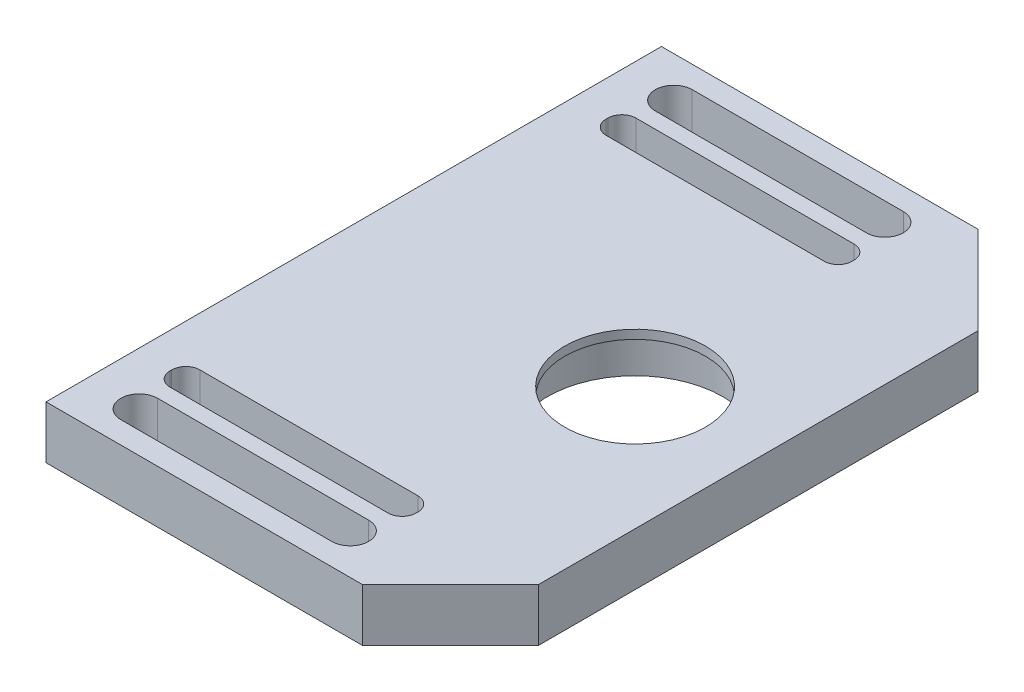
ISO-10303-21;
HEADER;
FILE_DESCRIPTION(('STEP AP214'),'2;1');
FILE_NAME('part.step','',(''),(''),'','','');
FILE_SCHEMA(('AUTOMOTIVE_DESIGN { 1 0 10303 214 1 1 1 1 }'));
ENDSEC;
DATA;
#1=APPLICATION_CONTEXT('core data for automotive mechanical design processes');
#2=APPLICATION_PROTOCOL_DEFINITION('international standard','automotive_design',2000,#1);
#3=PRODUCT_CONTEXT('',#1,'mechanical');
#4=PRODUCT('Part','Part','',(#3));
#5=PRODUCT_RELATED_PRODUCT_CATEGORY('part','',(#4));
#6=PRODUCT_DEFINITION_FORMATION('','',#4);
#7=PRODUCT_DEFINITION_CONTEXT('part definition',#1,'design');
#8=PRODUCT_DEFINITION('design','',#6,#7);
#9=PRODUCT_DEFINITION_SHAPE('','',#8);
#10=(LENGTH_UNIT() NAMED_UNIT(*) SI_UNIT(.MILLI.,.METRE.));
#11=(NAMED_UNIT(*) PLANE_ANGLE_UNIT() SI_UNIT($,.RADIAN.));
#12=(NAMED_UNIT(*) SI_UNIT($,.STERADIAN.) SOLID_ANGLE_UNIT());
#13=UNCERTAINTY_MEASURE_WITH_UNIT(LENGTH_MEASURE(1.E-05),#10,'distance_accuracy_value','');
#14=(GEOMETRIC_REPRESENTATION_CONTEXT(3) GLOBAL_UNCERTAINTY_ASSIGNED_CONTEXT((#13)) GLOBAL_UNIT_ASSIGNED_CONTEXT((#10,
#11,#12)) REPRESENTATION_CONTEXT('',''));
#15=CARTESIAN_POINT('',(0.,0.,0.));
#16=DIRECTION('',(0.,0.,1.));
#17=DIRECTION('',(1.,0.,0.));
#18=AXIS2_PLACEMENT_3D('',#15,#16,#17);
#19=CARTESIAN_POINT('',(-9.,-1.5,-17.5));
#20=DIRECTION('',(-1.,0.,0.));
#21=DIRECTION('',(0.,0.,1.));
#22=AXIS2_PLACEMENT_3D('',#19,#20,#21);
#23=PLANE('',#22);
#24=DIRECTION('',(0.,0.,1.));
#25=VECTOR('',#24,1.);
#26=CARTESIAN_POINT('',(-9.,1.5,-17.5));
#27=LINE('',#26,#25);
#28=CARTESIAN_POINT('',(-9.,1.5,-17.5));
#29=VERTEX_POINT('',#28);
#30=CARTESIAN_POINT('',(-9.,1.5,17.5));
#31=VERTEX_POINT('',#30);
#32=EDGE_CURVE('E323',#29,#31,#27,.T.);
#33=ORIENTED_EDGE('',*,*,#32,.F.);
#34=DIRECTION('',(0.,1.,0.));
#35=VECTOR('',#34,1.);
#36=CARTESIAN_POINT('',(-9.,-1.5,-17.5));
#37=LINE('',#36,#35);
#38=CARTESIAN_POINT('',(-9.,-1.5,-17.5));
#39=VERTEX_POINT('',#38);
#40=EDGE_CURVE('E369',#39,#29,#37,.T.);
#41=ORIENTED_EDGE('',*,*,#40,.F.);
#42=DIRECTION('',(0.,0.,1.));
#43=VECTOR('',#42,1.);
#44=CARTESIAN_POINT('',(-9.,-1.5,-17.5));
#45=LINE('',#44,#43);
#46=CARTESIAN_POINT('',(-9.,-1.5,17.5));
#47=VERTEX_POINT('',#46);
#48=EDGE_CURVE('E333',#39,#47,#45,.T.);
#49=ORIENTED_EDGE('',*,*,#48,.T.);
#50=DIRECTION('',(0.,1.,0.));
#51=VECTOR('',#50,1.);
#52=CARTESIAN_POINT('',(-9.,-1.5,17.5));
#53=LINE('',#52,#51);
#54=EDGE_CURVE('E352',#47,#31,#53,.T.);
#55=ORIENTED_EDGE('',*,*,#54,.T.);
#56=EDGE_LOOP('',(#33,#41,#49,#55));
#57=FACE_BOUND('',#56,.T.);
#58=ADVANCED_FACE('F34',(#57),#23,.T.);
#59=CARTESIAN_POINT('',(-9.,-1.5,-17.5));
#60=DIRECTION('',(0.,0.,-1.));
#61=DIRECTION('',(-1.,0.,0.));
#62=AXIS2_PLACEMENT_3D('',#59,#60,#61);
#63=PLANE('',#62);
#64=DIRECTION('',(-1.,0.,0.));
#65=VECTOR('',#64,1.);
#66=CARTESIAN_POINT('',(-9.,1.5,-17.5));
#67=LINE('',#66,#65);
#68=CARTESIAN_POINT('',(9.,1.5,-17.5));
#69=VERTEX_POINT('',#68);
#70=EDGE_CURVE('E337',#69,#29,#67,.T.);
#71=ORIENTED_EDGE('',*,*,#70,.F.);
#72=DIRECTION('',(0.,1.,0.));
#73=VECTOR('',#72,1.);
#74=CARTESIAN_POINT('',(9.,-1.5,-17.5));
#75=LINE('',#74,#73);
#76=CARTESIAN_POINT('',(9.,-1.5,-17.5));
#77=VERTEX_POINT('',#76);
#78=EDGE_CURVE('E372',#77,#69,#75,.T.);
#79=ORIENTED_EDGE('',*,*,#78,.F.);
#80=DIRECTION('',(-1.,0.,0.));
#81=VECTOR('',#80,1.);
#82=CARTESIAN_POINT('',(-9.,-1.5,-17.5));
#83=LINE('',#82,#81);
#84=EDGE_CURVE('E349',#77,#39,#83,.T.);
#85=ORIENTED_EDGE('',*,*,#84,.T.);
#86=ORIENTED_EDGE('',*,*,#40,.T.);
#87=EDGE_LOOP('',(#71,#79,#85,#86));
#88=FACE_BOUND('',#87,.T.);
#89=ADVANCED_FACE('F494',(#88),#63,.T.);
#90=CARTESIAN_POINT('',(14.,-1.5,-12.5));
#91=DIRECTION('',(0.707106781186549,0.,-0.707106781186546));
#92=DIRECTION('',(-0.707106781186546,0.,-0.707106781186549));
#93=AXIS2_PLACEMENT_3D('',#90,#91,#92);
#94=PLANE('',#93);
#95=DIRECTION('',(-0.707106781186546,0.,-0.707106781186549));
#96=VECTOR('',#95,1.);
#97=CARTESIAN_POINT('',(14.,1.5,-12.5));
#98=LINE('',#97,#96);
#99=CARTESIAN_POINT('',(14.,1.5,-12.5));
#100=VERTEX_POINT('',#99);
#101=EDGE_CURVE('E364',#100,#69,#98,.T.);
#102=ORIENTED_EDGE('',*,*,#101,.F.);
#103=DIRECTION('',(0.,1.,0.));
#104=VECTOR('',#103,1.);
#105=CARTESIAN_POINT('',(14.,-1.5,-12.5));
#106=LINE('',#105,#104);
#107=CARTESIAN_POINT('',(14.,-1.5,-12.5));
#108=VERTEX_POINT('',#107);
#109=EDGE_CURVE('E374',#108,#100,#106,.T.);
#110=ORIENTED_EDGE('',*,*,#109,.F.);
#111=DIRECTION('',(-0.707106781186546,0.,-0.707106781186549));
#112=VECTOR('',#111,1.);
#113=CARTESIAN_POINT('',(14.,-1.5,-12.5));
#114=LINE('',#113,#112);
#115=EDGE_CURVE('E346',#108,#77,#114,.T.);
#116=ORIENTED_EDGE('',*,*,#115,.T.);
#117=ORIENTED_EDGE('',*,*,#78,.T.);
#118=EDGE_LOOP('',(#102,#110,#116,#117));
#119=FACE_BOUND('',#118,.T.);
#120=ADVANCED_FACE('F500',(#119),#94,.T.);
#121=CARTESIAN_POINT('',(14.,-1.5,12.5));
#122=DIRECTION('',(1.,0.,0.));
#123=DIRECTION('',(0.,0.,-1.));
#124=AXIS2_PLACEMENT_3D('',#121,#122,#123);
#125=PLANE('',#124);
#126=DIRECTION('',(0.,0.,-1.));
#127=VECTOR('',#126,1.);
#128=CARTESIAN_POINT('',(14.,1.5,12.5));
#129=LINE('',#128,#127);
#130=CARTESIAN_POINT('',(14.,1.5,12.5));
#131=VERTEX_POINT('',#130);
#132=EDGE_CURVE('E361',#131,#100,#129,.T.);
#133=ORIENTED_EDGE('',*,*,#132,.F.);
#134=DIRECTION('',(0.,1.,0.));
#135=VECTOR('',#134,1.);
#136=CARTESIAN_POINT('',(14.,-1.5,12.5));
#137=LINE('',#136,#135);
#138=CARTESIAN_POINT('',(14.,-1.5,12.5));
#139=VERTEX_POINT('',#138);
#140=EDGE_CURVE('E376',#139,#131,#137,.T.);
#141=ORIENTED_EDGE('',*,*,#140,.F.);
#142=DIRECTION('',(0.,0.,-1.));
#143=VECTOR('',#142,1.);
#144=CARTESIAN_POINT('',(14.,-1.5,12.5));
#145=LINE('',#144,#143);
#146=EDGE_CURVE('E343',#139,#108,#145,.T.);
#147=ORIENTED_EDGE('',*,*,#146,.T.);
#148=ORIENTED_EDGE('',*,*,#109,.T.);
#149=EDGE_LOOP('',(#133,#141,#147,#148));
#150=FACE_BOUND('',#149,.T.);
#151=ADVANCED_FACE('F628',(#150),#125,.T.);
#152=CARTESIAN_POINT('',(9.,-1.5,17.5));
#153=DIRECTION('',(0.707106781186549,0.,0.707106781186546));
#154=DIRECTION('',(0.707106781186546,0.,-0.707106781186549));
#155=AXIS2_PLACEMENT_3D('',#152,#153,#154);
#156=PLANE('',#155);
#157=DIRECTION('',(0.707106781186546,0.,-0.707106781186549));
#158=VECTOR('',#157,1.);
#159=CARTESIAN_POINT('',(9.,1.5,17.5));
#160=LINE('',#159,#158);
#161=CARTESIAN_POINT('',(9.,1.5,17.5));
#162=VERTEX_POINT('',#161);
#163=EDGE_CURVE('E358',#162,#131,#160,.T.);
#164=ORIENTED_EDGE('',*,*,#163,.F.);
#165=DIRECTION('',(0.,1.,0.));
#166=VECTOR('',#165,1.);
#167=CARTESIAN_POINT('',(9.,-1.5,17.5));
#168=LINE('',#167,#166);
#169=CARTESIAN_POINT('',(9.,-1.5,17.5));
#170=VERTEX_POINT('',#169);
#171=EDGE_CURVE('E378',#170,#162,#168,.T.);
#172=ORIENTED_EDGE('',*,*,#171,.F.);
#173=DIRECTION('',(0.707106781186546,0.,-0.707106781186549));
#174=VECTOR('',#173,1.);
#175=CARTESIAN_POINT('',(9.,-1.5,17.5));
#176=LINE('',#175,#174);
#177=EDGE_CURVE('E340',#170,#139,#176,.T.);
#178=ORIENTED_EDGE('',*,*,#177,.T.);
#179=ORIENTED_EDGE('',*,*,#140,.T.);
#180=EDGE_LOOP('',(#164,#172,#178,#179));
#181=FACE_BOUND('',#180,.T.);
#182=ADVANCED_FACE('F631',(#181),#156,.T.);
#183=CARTESIAN_POINT('',(-9.,-1.5,17.5));
#184=DIRECTION('',(0.,0.,1.));
#185=DIRECTION('',(1.,0.,0.));
#186=AXIS2_PLACEMENT_3D('',#183,#184,#185);
#187=PLANE('',#186);
#188=DIRECTION('',(1.,0.,0.));
#189=VECTOR('',#188,1.);
#190=CARTESIAN_POINT('',(-9.,1.5,17.5));
#191=LINE('',#190,#189);
#192=EDGE_CURVE('E355',#31,#162,#191,.T.);
#193=ORIENTED_EDGE('',*,*,#192,.F.);
#194=ORIENTED_EDGE('',*,*,#54,.F.);
#195=DIRECTION('',(1.,0.,0.));
#196=VECTOR('',#195,1.);
#197=CARTESIAN_POINT('',(-9.,-1.5,17.5));
#198=LINE('',#197,#196);
#199=EDGE_CURVE('E336',#47,#170,#198,.T.);
#200=ORIENTED_EDGE('',*,*,#199,.T.);
#201=ORIENTED_EDGE('',*,*,#171,.T.);
#202=EDGE_LOOP('',(#193,#194,#200,#201));
#203=FACE_BOUND('',#202,.T.);
#204=ADVANCED_FACE('F506',(#203),#187,.T.);
#205=CARTESIAN_POINT('',(0.,-1.5,0.));
#206=DIRECTION('',(0.,1.,0.));
#207=DIRECTION('',(0.,0.,1.));
#208=AXIS2_PLACEMENT_3D('',#205,#206,#207);
#209=PLANE('',#208);
#210=CARTESIAN_POINT('',(7.,-1.5,0.));
#211=DIRECTION('',(0.,-1.,0.));
#212=DIRECTION('',(0.,0.,-1.));
#213=AXIS2_PLACEMENT_3D('',#210,#211,#212);
#214=CIRCLE('',#213,5.);
#215=CARTESIAN_POINT('',(7.,-1.5,-5.));
#216=VERTEX_POINT('',#215);
#217=EDGE_CURVE('E811',#216,#216,#214,.T.);
#218=ORIENTED_EDGE('',*,*,#217,.F.);
#219=EDGE_LOOP('',(#218));
#220=FACE_BOUND('',#219,.T.);
#221=DIRECTION('',(-1.,0.,0.));
#222=VECTOR('',#221,1.);
#223=CARTESIAN_POINT('',(-7.,-1.5,11.55));
#224=LINE('',#223,#222);
#225=CARTESIAN_POINT('',(6.2,-1.5,11.55));
#226=VERTEX_POINT('',#225);
#227=CARTESIAN_POINT('',(-6.2,-1.5,11.55));
#228=VERTEX_POINT('',#227);
#229=EDGE_CURVE('E540',#226,#228,#224,.T.);
#230=ORIENTED_EDGE('',*,*,#229,.T.);
#231=CARTESIAN_POINT('',(-6.2,-1.5,12.35));
#232=DIRECTION('',(0.,1.,0.));
#233=DIRECTION('',(0.,0.,1.));
#234=AXIS2_PLACEMENT_3D('',#231,#232,#233);
#235=CIRCLE('',#234,0.8);
#236=CARTESIAN_POINT('',(-7.,-1.5,12.35));
#237=VERTEX_POINT('',#236);
#238=EDGE_CURVE('E433',#228,#237,#235,.T.);
#239=ORIENTED_EDGE('',*,*,#238,.T.);
#240=DIRECTION('',(0.,0.,1.));
#241=VECTOR('',#240,1.);
#242=CARTESIAN_POINT('',(-7.,-1.5,13.25));
#243=LINE('',#242,#241);
#244=CARTESIAN_POINT('',(-7.,-1.5,12.45));
#245=VERTEX_POINT('',#244);
#246=EDGE_CURVE('E270',#237,#245,#243,.T.);
#247=ORIENTED_EDGE('',*,*,#246,.T.);
#248=CARTESIAN_POINT('',(-6.2,-1.5,12.45));
#249=DIRECTION('',(0.,1.,0.));
#250=DIRECTION('',(0.,0.,1.));
#251=AXIS2_PLACEMENT_3D('',#248,#249,#250);
#252=CIRCLE('',#251,0.8);
#253=CARTESIAN_POINT('',(-6.2,-1.5,13.25));
#254=VERTEX_POINT('',#253);
#255=EDGE_CURVE('E429',#245,#254,#252,.T.);
#256=ORIENTED_EDGE('',*,*,#255,.T.);
#257=DIRECTION('',(1.,0.,0.));
#258=VECTOR('',#257,1.);
#259=CARTESIAN_POINT('',(-7.,-1.5,13.25));
#260=LINE('',#259,#258);
#261=CARTESIAN_POINT('',(6.2,-1.5,13.25));
#262=VERTEX_POINT('',#261);
#263=EDGE_CURVE('E529',#254,#262,#260,.T.);
#264=ORIENTED_EDGE('',*,*,#263,.T.);
#265=CARTESIAN_POINT('',(6.2,-1.5,12.45));
#266=DIRECTION('',(0.,1.,0.));
#267=DIRECTION('',(0.,0.,1.));
#268=AXIS2_PLACEMENT_3D('',#265,#266,#267);
#269=CIRCLE('',#268,0.8);
#270=CARTESIAN_POINT('',(7.,-1.5,12.45));
#271=VERTEX_POINT('',#270);
#272=EDGE_CURVE('E421',#262,#271,#269,.T.);
#273=ORIENTED_EDGE('',*,*,#272,.T.);
#274=DIRECTION('',(0.,0.,-1.));
#275=VECTOR('',#274,1.);
#276=CARTESIAN_POINT('',(7.,-1.5,13.25));
#277=LINE('',#276,#275);
#278=CARTESIAN_POINT('',(7.,-1.5,12.35));
#279=VERTEX_POINT('',#278);
#280=EDGE_CURVE('E537',#271,#279,#277,.T.);
#281=ORIENTED_EDGE('',*,*,#280,.T.);
#282=CARTESIAN_POINT('',(6.2,-1.5,12.35));
#283=DIRECTION('',(0.,1.,0.));
#284=DIRECTION('',(0.,0.,1.));
#285=AXIS2_PLACEMENT_3D('',#282,#283,#284);
#286=CIRCLE('',#285,0.8);
#287=EDGE_CURVE('E425',#279,#226,#286,.T.);
#288=ORIENTED_EDGE('',*,*,#287,.T.);
#289=EDGE_LOOP('',(#230,#239,#247,#256,#264,#273,#281,#288));
#290=FACE_BOUND('',#289,.T.);
#291=DIRECTION('',(-1.,0.,0.));
#292=VECTOR('',#291,1.);
#293=CARTESIAN_POINT('',(-5.99999999999999,-1.5,14.15));
#294=LINE('',#293,#292);
#295=CARTESIAN_POINT('',(6.,-1.5,14.15));
#296=VERTEX_POINT('',#295);
#297=CARTESIAN_POINT('',(-5.99999999999999,-1.5,14.15));
#298=VERTEX_POINT('',#297);
#299=EDGE_CURVE('E244',#296,#298,#294,.T.);
#300=ORIENTED_EDGE('',*,*,#299,.T.);
#301=CARTESIAN_POINT('',(-5.99999999999999,-1.5,15.2));
#302=DIRECTION('',(0.,1.,0.));
#303=DIRECTION('',(0.,0.,-1.));
#304=AXIS2_PLACEMENT_3D('',#301,#302,#303);
#305=CIRCLE('',#304,1.05);
#306=CARTESIAN_POINT('',(-5.99999999999999,-1.5,16.25));
#307=VERTEX_POINT('',#306);
#308=EDGE_CURVE('E236',#298,#307,#305,.T.);
#309=ORIENTED_EDGE('',*,*,#308,.T.);
#310=DIRECTION('',(1.,0.,0.));
#311=VECTOR('',#310,1.);
#312=CARTESIAN_POINT('',(-5.99999999999999,-1.5,16.25));
#313=LINE('',#312,#311);
#314=CARTESIAN_POINT('',(6.,-1.5,16.25));
#315=VERTEX_POINT('',#314);
#316=EDGE_CURVE('E248',#307,#315,#313,.T.);
#317=ORIENTED_EDGE('',*,*,#316,.T.);
#318=CARTESIAN_POINT('',(6.,-1.5,15.2));
#319=DIRECTION('',(0.,1.,0.));
#320=DIRECTION('',(0.,0.,-1.));
#321=AXIS2_PLACEMENT_3D('',#318,#319,#320);
#322=CIRCLE('',#321,1.05);
#323=EDGE_CURVE('E252',#315,#296,#322,.T.);
#324=ORIENTED_EDGE('',*,*,#323,.T.);
#325=EDGE_LOOP('',(#300,#309,#317,#324));
#326=FACE_BOUND('',#325,.T.);
#327=DIRECTION('',(-1.,0.,0.));
#328=VECTOR('',#327,1.);
#329=CARTESIAN_POINT('',(-6.,-1.5,-16.25));
#330=LINE('',#329,#328);
#331=CARTESIAN_POINT('',(6.,-1.5,-16.25));
#332=VERTEX_POINT('',#331);
#333=CARTESIAN_POINT('',(-6.,-1.5,-16.25));
#334=VERTEX_POINT('',#333);
#335=EDGE_CURVE('E290',#332,#334,#330,.T.);
#336=ORIENTED_EDGE('',*,*,#335,.T.);
#337=CARTESIAN_POINT('',(-6.,-1.5,-15.2));
#338=DIRECTION('',(0.,1.,0.));
#339=DIRECTION('',(0.,0.,1.));
#340=AXIS2_PLACEMENT_3D('',#337,#338,#339);
#341=CIRCLE('',#340,1.05);
#342=CARTESIAN_POINT('',(-5.99999999999999,-1.5,-14.15));
#343=VERTEX_POINT('',#342);
#344=EDGE_CURVE('E280',#334,#343,#341,.T.);
#345=ORIENTED_EDGE('',*,*,#344,.T.);
#346=DIRECTION('',(1.,0.,0.));
#347=VECTOR('',#346,1.);
#348=CARTESIAN_POINT('',(-5.99999999999999,-1.5,-14.15));
#349=LINE('',#348,#347);
#350=CARTESIAN_POINT('',(5.99999999999999,-1.5,-14.15));
#351=VERTEX_POINT('',#350);
#352=EDGE_CURVE('E283',#343,#351,#349,.T.);
#353=ORIENTED_EDGE('',*,*,#352,.T.);
#354=CARTESIAN_POINT('',(6.,-1.5,-15.2));
#355=DIRECTION('',(0.,1.,0.));
#356=DIRECTION('',(0.,0.,1.));
#357=AXIS2_PLACEMENT_3D('',#354,#355,#356);
#358=CIRCLE('',#357,1.05);
#359=EDGE_CURVE('E287',#351,#332,#358,.T.);
#360=ORIENTED_EDGE('',*,*,#359,.T.);
#361=EDGE_LOOP('',(#336,#345,#353,#360));
#362=FACE_BOUND('',#361,.T.);
#363=DIRECTION('',(0.,0.,-1.));
#364=VECTOR('',#363,1.);
#365=CARTESIAN_POINT('',(7.,-1.5,-13.25));
#366=LINE('',#365,#364);
#367=CARTESIAN_POINT('',(7.,-1.5,-12.35));
#368=VERTEX_POINT('',#367);
#369=CARTESIAN_POINT('',(7.,-1.5,-12.45));
#370=VERTEX_POINT('',#369);
#371=EDGE_CURVE('E318',#368,#370,#366,.T.);
#372=ORIENTED_EDGE('',*,*,#371,.T.);
#373=CARTESIAN_POINT('',(6.2,-1.5,-12.45));
#374=DIRECTION('',(0.,1.,0.));
#375=DIRECTION('',(0.,0.,1.));
#376=AXIS2_PLACEMENT_3D('',#373,#374,#375);
#377=CIRCLE('',#376,0.8);
#378=CARTESIAN_POINT('',(6.2,-1.5,-13.25));
#379=VERTEX_POINT('',#378);
#380=EDGE_CURVE('E437',#370,#379,#377,.T.);
#381=ORIENTED_EDGE('',*,*,#380,.T.);
#382=DIRECTION('',(-1.,0.,0.));
#383=VECTOR('',#382,1.);
#384=CARTESIAN_POINT('',(-7.,-1.5,-13.25));
#385=LINE('',#384,#383);
#386=CARTESIAN_POINT('',(-6.2,-1.5,-13.25));
#387=VERTEX_POINT('',#386);
#388=EDGE_CURVE('E321',#379,#387,#385,.T.);
#389=ORIENTED_EDGE('',*,*,#388,.T.);
#390=CARTESIAN_POINT('',(-6.2,-1.5,-12.45));
#391=DIRECTION('',(0.,1.,0.));
#392=DIRECTION('',(0.,0.,1.));
#393=AXIS2_PLACEMENT_3D('',#390,#391,#392);
#394=CIRCLE('',#393,0.8);
#395=CARTESIAN_POINT('',(-7.,-1.5,-12.45));
#396=VERTEX_POINT('',#395);
#397=EDGE_CURVE('E12',#387,#396,#394,.T.);
#398=ORIENTED_EDGE('',*,*,#397,.T.);
#399=DIRECTION('',(0.,0.,1.));
#400=VECTOR('',#399,1.);
#401=CARTESIAN_POINT('',(-7.,-1.5,-13.25));
#402=LINE('',#401,#400);
#403=CARTESIAN_POINT('',(-7.,-1.5,-12.35));
#404=VERTEX_POINT('',#403);
#405=EDGE_CURVE('E312',#396,#404,#402,.T.);
#406=ORIENTED_EDGE('',*,*,#405,.T.);
#407=CARTESIAN_POINT('',(-6.2,-1.5,-12.35));
#408=DIRECTION('',(0.,1.,0.));
#409=DIRECTION('',(0.,0.,1.));
#410=AXIS2_PLACEMENT_3D('',#407,#408,#409);
#411=CIRCLE('',#410,0.8);
#412=CARTESIAN_POINT('',(-6.2,-1.5,-11.55));
#413=VERTEX_POINT('',#412);
#414=EDGE_CURVE('E445',#404,#413,#411,.T.);
#415=ORIENTED_EDGE('',*,*,#414,.T.);
#416=DIRECTION('',(1.,0.,0.));
#417=VECTOR('',#416,1.);
#418=CARTESIAN_POINT('',(-7.,-1.5,-11.55));
#419=LINE('',#418,#417);
#420=CARTESIAN_POINT('',(6.2,-1.5,-11.55));
#421=VERTEX_POINT('',#420);
#422=EDGE_CURVE('E314',#413,#421,#419,.T.);
#423=ORIENTED_EDGE('',*,*,#422,.T.);
#424=CARTESIAN_POINT('',(6.2,-1.5,-12.35));
#425=DIRECTION('',(0.,1.,0.));
#426=DIRECTION('',(0.,0.,1.));
#427=AXIS2_PLACEMENT_3D('',#424,#425,#426);
#428=CIRCLE('',#427,0.8);
#429=EDGE_CURVE('E441',#421,#368,#428,.T.);
#430=ORIENTED_EDGE('',*,*,#429,.T.);
#431=EDGE_LOOP('',(#372,#381,#389,#398,#406,#415,#423,#430));
#432=FACE_BOUND('',#431,.T.);
#433=ORIENTED_EDGE('',*,*,#48,.F.);
#434=ORIENTED_EDGE('',*,*,#84,.F.);
#435=ORIENTED_EDGE('',*,*,#115,.F.);
#436=ORIENTED_EDGE('',*,*,#146,.F.);
#437=ORIENTED_EDGE('',*,*,#177,.F.);
#438=ORIENTED_EDGE('',*,*,#199,.F.);
#439=EDGE_LOOP('',(#433,#434,#435,#436,#437,#438));
#440=FACE_BOUND('',#439,.T.);
#441=ADVANCED_FACE('F254',(#220,#290,#326,#362,#432,#440),#209,.F.);
#442=CARTESIAN_POINT('',(0.,1.5,0.));
#443=DIRECTION('',(0.,1.,0.));
#444=DIRECTION('',(0.,0.,1.));
#445=AXIS2_PLACEMENT_3D('',#442,#443,#444);
#446=PLANE('',#445);
#447=CARTESIAN_POINT('',(7.,1.5,0.));
#448=DIRECTION('',(0.,-1.,0.));
#449=DIRECTION('',(0.,0.,-1.));
#450=AXIS2_PLACEMENT_3D('',#447,#448,#449);
#451=CIRCLE('',#450,4.);
#452=CARTESIAN_POINT('',(7.,1.5,-4.));
#453=VERTEX_POINT('',#452);
#454=EDGE_CURVE('E808',#453,#453,#451,.T.);
#455=ORIENTED_EDGE('',*,*,#454,.T.);
#456=EDGE_LOOP('',(#455));
#457=FACE_BOUND('',#456,.T.);
#458=DIRECTION('',(1.,0.,0.));
#459=VECTOR('',#458,1.);
#460=CARTESIAN_POINT('',(-7.,1.5,13.25));
#461=LINE('',#460,#459);
#462=CARTESIAN_POINT('',(-6.2,1.5,13.25));
#463=VERTEX_POINT('',#462);
#464=CARTESIAN_POINT('',(6.2,1.5,13.25));
#465=VERTEX_POINT('',#464);
#466=EDGE_CURVE('E550',#463,#465,#461,.T.);
#467=ORIENTED_EDGE('',*,*,#466,.F.);
#468=CARTESIAN_POINT('',(-6.2,1.5,12.45));
#469=DIRECTION('',(0.,1.,0.));
#470=DIRECTION('',(0.,0.,1.));
#471=AXIS2_PLACEMENT_3D('',#468,#469,#470);
#472=CIRCLE('',#471,0.8);
#473=CARTESIAN_POINT('',(-7.,1.5,12.45));
#474=VERTEX_POINT('',#473);
#475=EDGE_CURVE('E427',#463,#474,#472,.F.);
#476=ORIENTED_EDGE('',*,*,#475,.T.);
#477=DIRECTION('',(0.,0.,1.));
#478=VECTOR('',#477,1.);
#479=CARTESIAN_POINT('',(-7.,1.5,13.25));
#480=LINE('',#479,#478);
#481=CARTESIAN_POINT('',(-7.,1.5,12.35));
#482=VERTEX_POINT('',#481);
#483=EDGE_CURVE('E263',#482,#474,#480,.T.);
#484=ORIENTED_EDGE('',*,*,#483,.F.);
#485=CARTESIAN_POINT('',(-6.2,1.5,12.35));
#486=DIRECTION('',(0.,1.,0.));
#487=DIRECTION('',(0.,0.,1.));
#488=AXIS2_PLACEMENT_3D('',#485,#486,#487);
#489=CIRCLE('',#488,0.8);
#490=CARTESIAN_POINT('',(-6.2,1.5,11.55));
#491=VERTEX_POINT('',#490);
#492=EDGE_CURVE('E431',#482,#491,#489,.F.);
#493=ORIENTED_EDGE('',*,*,#492,.T.);
#494=DIRECTION('',(-1.,0.,0.));
#495=VECTOR('',#494,1.);
#496=CARTESIAN_POINT('',(-7.,1.5,11.55));
#497=LINE('',#496,#495);
#498=CARTESIAN_POINT('',(6.2,1.5,11.55));
#499=VERTEX_POINT('',#498);
#500=EDGE_CURVE('E543',#499,#491,#497,.T.);
#501=ORIENTED_EDGE('',*,*,#500,.F.);
#502=CARTESIAN_POINT('',(6.2,1.5,12.35));
#503=DIRECTION('',(0.,1.,0.));
#504=DIRECTION('',(0.,0.,1.));
#505=AXIS2_PLACEMENT_3D('',#502,#503,#504);
#506=CIRCLE('',#505,0.8);
#507=CARTESIAN_POINT('',(7.,1.5,12.35));
#508=VERTEX_POINT('',#507);
#509=EDGE_CURVE('E423',#499,#508,#506,.F.);
#510=ORIENTED_EDGE('',*,*,#509,.T.);
#511=DIRECTION('',(0.,0.,-1.));
#512=VECTOR('',#511,1.);
#513=CARTESIAN_POINT('',(7.,1.5,13.25));
#514=LINE('',#513,#512);
#515=CARTESIAN_POINT('',(7.,1.5,12.45));
#516=VERTEX_POINT('',#515);
#517=EDGE_CURVE('E552',#516,#508,#514,.T.);
#518=ORIENTED_EDGE('',*,*,#517,.F.);
#519=CARTESIAN_POINT('',(6.2,1.5,12.45));
#520=DIRECTION('',(0.,1.,0.));
#521=DIRECTION('',(0.,0.,1.));
#522=AXIS2_PLACEMENT_3D('',#519,#520,#521);
#523=CIRCLE('',#522,0.8);
#524=EDGE_CURVE('E419',#516,#465,#523,.F.);
#525=ORIENTED_EDGE('',*,*,#524,.T.);
#526=EDGE_LOOP('',(#467,#476,#484,#493,#501,#510,#518,#525));
#527=FACE_BOUND('',#526,.T.);
#528=CARTESIAN_POINT('',(-5.99999999999999,1.5,15.2));
#529=DIRECTION('',(0.,1.,0.));
#530=DIRECTION('',(0.,0.,-1.));
#531=AXIS2_PLACEMENT_3D('',#528,#529,#530);
#532=CIRCLE('',#531,1.05);
#533=CARTESIAN_POINT('',(-5.99999999999999,1.5,14.15));
#534=VERTEX_POINT('',#533);
#535=CARTESIAN_POINT('',(-5.99999999999999,1.5,16.25));
#536=VERTEX_POINT('',#535);
#537=EDGE_CURVE('E239',#534,#536,#532,.T.);
#538=ORIENTED_EDGE('',*,*,#537,.F.);
#539=DIRECTION('',(-1.,0.,0.));
#540=VECTOR('',#539,1.);
#541=CARTESIAN_POINT('',(-5.99999999999999,1.5,14.15));
#542=LINE('',#541,#540);
#543=CARTESIAN_POINT('',(6.,1.5,14.15));
#544=VERTEX_POINT('',#543);
#545=EDGE_CURVE('E257',#544,#534,#542,.T.);
#546=ORIENTED_EDGE('',*,*,#545,.F.);
#547=CARTESIAN_POINT('',(6.,1.5,15.2));
#548=DIRECTION('',(0.,1.,0.));
#549=DIRECTION('',(0.,0.,-1.));
#550=AXIS2_PLACEMENT_3D('',#547,#548,#549);
#551=CIRCLE('',#550,1.05);
#552=CARTESIAN_POINT('',(6.,1.5,16.25));
#553=VERTEX_POINT('',#552);
#554=EDGE_CURVE('E260',#553,#544,#551,.T.);
#555=ORIENTED_EDGE('',*,*,#554,.F.);
#556=DIRECTION('',(1.,0.,0.));
#557=VECTOR('',#556,1.);
#558=CARTESIAN_POINT('',(-5.99999999999999,1.5,16.25));
#559=LINE('',#558,#557);
#560=EDGE_CURVE('E269',#536,#553,#559,.T.);
#561=ORIENTED_EDGE('',*,*,#560,.F.);
#562=EDGE_LOOP('',(#538,#546,#555,#561));
#563=FACE_BOUND('',#562,.T.);
#564=CARTESIAN_POINT('',(-6.,1.5,-15.2));
#565=DIRECTION('',(0.,1.,0.));
#566=DIRECTION('',(0.,0.,1.));
#567=AXIS2_PLACEMENT_3D('',#564,#565,#566);
#568=CIRCLE('',#567,1.05);
#569=CARTESIAN_POINT('',(-6.,1.5,-16.25));
#570=VERTEX_POINT('',#569);
#571=CARTESIAN_POINT('',(-5.99999999999999,1.5,-14.15));
#572=VERTEX_POINT('',#571);
#573=EDGE_CURVE('E276',#570,#572,#568,.T.);
#574=ORIENTED_EDGE('',*,*,#573,.F.);
#575=DIRECTION('',(-1.,0.,0.));
#576=VECTOR('',#575,1.);
#577=CARTESIAN_POINT('',(-6.,1.5,-16.25));
#578=LINE('',#577,#576);
#579=CARTESIAN_POINT('',(6.,1.5,-16.25));
#580=VERTEX_POINT('',#579);
#581=EDGE_CURVE('E284',#580,#570,#578,.T.);
#582=ORIENTED_EDGE('',*,*,#581,.F.);
#583=CARTESIAN_POINT('',(6.,1.5,-15.2));
#584=DIRECTION('',(0.,1.,0.));
#585=DIRECTION('',(0.,0.,1.));
#586=AXIS2_PLACEMENT_3D('',#583,#584,#585);
#587=CIRCLE('',#586,1.05);
#588=CARTESIAN_POINT('',(5.99999999999999,1.5,-14.15));
#589=VERTEX_POINT('',#588);
#590=EDGE_CURVE('E298',#589,#580,#587,.T.);
#591=ORIENTED_EDGE('',*,*,#590,.F.);
#592=DIRECTION('',(1.,0.,0.));
#593=VECTOR('',#592,1.);
#594=CARTESIAN_POINT('',(-5.99999999999999,1.5,-14.15));
#595=LINE('',#594,#593);
#596=EDGE_CURVE('E295',#572,#589,#595,.T.);
#597=ORIENTED_EDGE('',*,*,#596,.F.);
#598=EDGE_LOOP('',(#574,#582,#591,#597));
#599=FACE_BOUND('',#598,.T.);
#600=DIRECTION('',(0.,0.,1.));
#601=VECTOR('',#600,1.);
#602=CARTESIAN_POINT('',(-7.,1.5,-13.25));
#603=LINE('',#602,#601);
#604=CARTESIAN_POINT('',(-7.,1.5,-12.45));
#605=VERTEX_POINT('',#604);
#606=CARTESIAN_POINT('',(-7.,1.5,-12.35));
#607=VERTEX_POINT('',#606);
#608=EDGE_CURVE('E305',#605,#607,#603,.T.);
#609=ORIENTED_EDGE('',*,*,#608,.F.);
#610=CARTESIAN_POINT('',(-6.2,1.5,-12.45));
#611=DIRECTION('',(0.,1.,0.));
#612=DIRECTION('',(0.,0.,1.));
#613=AXIS2_PLACEMENT_3D('',#610,#611,#612);
#614=CIRCLE('',#613,0.8);
#615=CARTESIAN_POINT('',(-6.2,1.5,-13.25));
#616=VERTEX_POINT('',#615);
#617=EDGE_CURVE('E43',#605,#616,#614,.F.);
#618=ORIENTED_EDGE('',*,*,#617,.T.);
#619=DIRECTION('',(-1.,0.,0.));
#620=VECTOR('',#619,1.);
#621=CARTESIAN_POINT('',(-7.,1.5,-13.25));
#622=LINE('',#621,#620);
#623=CARTESIAN_POINT('',(6.2,1.5,-13.25));
#624=VERTEX_POINT('',#623);
#625=EDGE_CURVE('E315',#624,#616,#622,.T.);
#626=ORIENTED_EDGE('',*,*,#625,.F.);
#627=CARTESIAN_POINT('',(6.2,1.5,-12.45));
#628=DIRECTION('',(0.,1.,0.));
#629=DIRECTION('',(0.,0.,1.));
#630=AXIS2_PLACEMENT_3D('',#627,#628,#629);
#631=CIRCLE('',#630,0.8);
#632=CARTESIAN_POINT('',(7.,1.5,-12.45));
#633=VERTEX_POINT('',#632);
#634=EDGE_CURVE('E435',#624,#633,#631,.F.);
#635=ORIENTED_EDGE('',*,*,#634,.T.);
#636=DIRECTION('',(0.,0.,-1.));
#637=VECTOR('',#636,1.);
#638=CARTESIAN_POINT('',(7.,1.5,-13.25));
#639=LINE('',#638,#637);
#640=CARTESIAN_POINT('',(7.,1.5,-12.35));
#641=VERTEX_POINT('',#640);
#642=EDGE_CURVE('E328',#641,#633,#639,.T.);
#643=ORIENTED_EDGE('',*,*,#642,.F.);
#644=CARTESIAN_POINT('',(6.2,1.5,-12.35));
#645=DIRECTION('',(0.,1.,0.));
#646=DIRECTION('',(0.,0.,1.));
#647=AXIS2_PLACEMENT_3D('',#644,#645,#646);
#648=CIRCLE('',#647,0.8);
#649=CARTESIAN_POINT('',(6.2,1.5,-11.55));
#650=VERTEX_POINT('',#649);
#651=EDGE_CURVE('E439',#641,#650,#648,.F.);
#652=ORIENTED_EDGE('',*,*,#651,.T.);
#653=DIRECTION('',(1.,0.,0.));
#654=VECTOR('',#653,1.);
#655=CARTESIAN_POINT('',(-7.,1.5,-11.55));
#656=LINE('',#655,#654);
#657=CARTESIAN_POINT('',(-6.2,1.5,-11.55));
#658=VERTEX_POINT('',#657);
#659=EDGE_CURVE('E325',#658,#650,#656,.T.);
#660=ORIENTED_EDGE('',*,*,#659,.F.);
#661=CARTESIAN_POINT('',(-6.2,1.5,-12.35));
#662=DIRECTION('',(0.,1.,0.));
#663=DIRECTION('',(0.,0.,1.));
#664=AXIS2_PLACEMENT_3D('',#661,#662,#663);
#665=CIRCLE('',#664,0.8);
#666=EDGE_CURVE('E443',#658,#607,#665,.F.);
#667=ORIENTED_EDGE('',*,*,#666,.T.);
#668=EDGE_LOOP('',(#609,#618,#626,#635,#643,#652,#660,#667));
#669=FACE_BOUND('',#668,.T.);
#670=ORIENTED_EDGE('',*,*,#32,.T.);
#671=ORIENTED_EDGE('',*,*,#192,.T.);
#672=ORIENTED_EDGE('',*,*,#163,.T.);
#673=ORIENTED_EDGE('',*,*,#132,.T.);
#674=ORIENTED_EDGE('',*,*,#101,.T.);
#675=ORIENTED_EDGE('',*,*,#70,.T.);
#676=EDGE_LOOP('',(#670,#671,#672,#673,#674,#675));
#677=FACE_BOUND('',#676,.T.);
#678=ADVANCED_FACE('F450',(#457,#527,#563,#599,#669,#677),#446,.T.);
#679=CARTESIAN_POINT('',(-7.,-1.5,-13.25));
#680=DIRECTION('',(-1.,0.,0.));
#681=DIRECTION('',(0.,0.,1.));
#682=AXIS2_PLACEMENT_3D('',#679,#680,#681);
#683=PLANE('',#682);
#684=ORIENTED_EDGE('',*,*,#608,.T.);
#685=DIRECTION('',(0.,1.,0.));
#686=VECTOR('',#685,1.);
#687=CARTESIAN_POINT('',(-7.,-1.5,-12.35));
#688=LINE('',#687,#686);
#689=EDGE_CURVE('E50',#607,#404,#688,.F.);
#690=ORIENTED_EDGE('',*,*,#689,.T.);
#691=ORIENTED_EDGE('',*,*,#405,.F.);
#692=DIRECTION('',(0.,1.,0.));
#693=VECTOR('',#692,1.);
#694=CARTESIAN_POINT('',(-7.,1.5,-12.45));
#695=LINE('',#694,#693);
#696=EDGE_CURVE('E415',#396,#605,#695,.T.);
#697=ORIENTED_EDGE('',*,*,#696,.T.);
#698=EDGE_LOOP('',(#684,#690,#691,#697));
#699=FACE_BOUND('',#698,.T.);
#700=ADVANCED_FACE('F459',(#699),#683,.F.);
#701=CARTESIAN_POINT('',(-7.,-1.5,-13.25));
#702=DIRECTION('',(0.,0.,-1.));
#703=DIRECTION('',(-1.,0.,0.));
#704=AXIS2_PLACEMENT_3D('',#701,#702,#703);
#705=PLANE('',#704);
#706=ORIENTED_EDGE('',*,*,#388,.F.);
#707=DIRECTION('',(0.,1.,0.));
#708=VECTOR('',#707,1.);
#709=CARTESIAN_POINT('',(6.2,1.5,-13.25));
#710=LINE('',#709,#708);
#711=EDGE_CURVE('E402',#379,#624,#710,.T.);
#712=ORIENTED_EDGE('',*,*,#711,.T.);
#713=ORIENTED_EDGE('',*,*,#625,.T.);
#714=DIRECTION('',(0.,1.,0.));
#715=VECTOR('',#714,1.);
#716=CARTESIAN_POINT('',(-6.2,-1.5,-13.25));
#717=LINE('',#716,#715);
#718=EDGE_CURVE('E400',#616,#387,#717,.F.);
#719=ORIENTED_EDGE('',*,*,#718,.T.);
#720=EDGE_LOOP('',(#706,#712,#713,#719));
#721=FACE_BOUND('',#720,.T.);
#722=ADVANCED_FACE('F457',(#721),#705,.F.);
#723=CARTESIAN_POINT('',(7.,-1.5,-13.25));
#724=DIRECTION('',(1.,0.,0.));
#725=DIRECTION('',(0.,0.,-1.));
#726=AXIS2_PLACEMENT_3D('',#723,#724,#725);
#727=PLANE('',#726);
#728=ORIENTED_EDGE('',*,*,#642,.T.);
#729=DIRECTION('',(0.,1.,0.));
#730=VECTOR('',#729,1.);
#731=CARTESIAN_POINT('',(7.,-1.5,-12.45));
#732=LINE('',#731,#730);
#733=EDGE_CURVE('E408',#633,#370,#732,.F.);
#734=ORIENTED_EDGE('',*,*,#733,.T.);
#735=ORIENTED_EDGE('',*,*,#371,.F.);
#736=DIRECTION('',(0.,1.,0.));
#737=VECTOR('',#736,1.);
#738=CARTESIAN_POINT('',(7.,1.5,-12.35));
#739=LINE('',#738,#737);
#740=EDGE_CURVE('E405',#368,#641,#739,.T.);
#741=ORIENTED_EDGE('',*,*,#740,.T.);
#742=EDGE_LOOP('',(#728,#734,#735,#741));
#743=FACE_BOUND('',#742,.T.);
#744=ADVANCED_FACE('F477',(#743),#727,.F.);
#745=CARTESIAN_POINT('',(-7.,-1.5,-11.55));
#746=DIRECTION('',(0.,0.,1.));
#747=DIRECTION('',(1.,0.,0.));
#748=AXIS2_PLACEMENT_3D('',#745,#746,#747);
#749=PLANE('',#748);
#750=ORIENTED_EDGE('',*,*,#659,.T.);
#751=DIRECTION('',(0.,1.,0.));
#752=VECTOR('',#751,1.);
#753=CARTESIAN_POINT('',(6.2,-1.5,-11.55));
#754=LINE('',#753,#752);
#755=EDGE_CURVE('E413',#650,#421,#754,.F.);
#756=ORIENTED_EDGE('',*,*,#755,.T.);
#757=ORIENTED_EDGE('',*,*,#422,.F.);
#758=DIRECTION('',(0.,1.,0.));
#759=VECTOR('',#758,1.);
#760=CARTESIAN_POINT('',(-6.2,1.5,-11.55));
#761=LINE('',#760,#759);
#762=EDGE_CURVE('E410',#413,#658,#761,.T.);
#763=ORIENTED_EDGE('',*,*,#762,.T.);
#764=EDGE_LOOP('',(#750,#756,#757,#763));
#765=FACE_BOUND('',#764,.T.);
#766=ADVANCED_FACE('F468',(#765),#749,.F.);
#767=CARTESIAN_POINT('',(-6.,-1.5,-15.2));
#768=DIRECTION('',(0.,1.,0.));
#769=DIRECTION('',(0.,0.,1.));
#770=AXIS2_PLACEMENT_3D('',#767,#768,#769);
#771=CYLINDRICAL_SURFACE('',#770,1.05);
#772=ORIENTED_EDGE('',*,*,#573,.T.);
#773=DIRECTION('',(0.,1.,0.));
#774=VECTOR('',#773,1.);
#775=CARTESIAN_POINT('',(-5.99999999999999,-1.5,-14.15));
#776=LINE('',#775,#774);
#777=EDGE_CURVE('E293',#343,#572,#776,.T.);
#778=ORIENTED_EDGE('',*,*,#777,.F.);
#779=ORIENTED_EDGE('',*,*,#344,.F.);
#780=DIRECTION('',(0.,1.,0.));
#781=VECTOR('',#780,1.);
#782=CARTESIAN_POINT('',(-6.,-1.5,-16.25));
#783=LINE('',#782,#781);
#784=EDGE_CURVE('E303',#334,#570,#783,.T.);
#785=ORIENTED_EDGE('',*,*,#784,.T.);
#786=EDGE_LOOP('',(#772,#778,#779,#785));
#787=FACE_BOUND('',#786,.T.);
#788=ADVANCED_FACE('F601',(#787),#771,.F.);
#789=CARTESIAN_POINT('',(-6.,-1.5,-16.25));
#790=DIRECTION('',(0.,0.,-1.));
#791=DIRECTION('',(-1.,0.,0.));
#792=AXIS2_PLACEMENT_3D('',#789,#790,#791);
#793=PLANE('',#792);
#794=ORIENTED_EDGE('',*,*,#581,.T.);
#795=ORIENTED_EDGE('',*,*,#784,.F.);
#796=ORIENTED_EDGE('',*,*,#335,.F.);
#797=DIRECTION('',(0.,1.,0.));
#798=VECTOR('',#797,1.);
#799=CARTESIAN_POINT('',(6.,-1.5,-16.25));
#800=LINE('',#799,#798);
#801=EDGE_CURVE('E306',#332,#580,#800,.T.);
#802=ORIENTED_EDGE('',*,*,#801,.T.);
#803=EDGE_LOOP('',(#794,#795,#796,#802));
#804=FACE_BOUND('',#803,.T.);
#805=ADVANCED_FACE('F597',(#804),#793,.F.);
#806=CARTESIAN_POINT('',(6.,-1.5,-15.2));
#807=DIRECTION('',(0.,1.,0.));
#808=DIRECTION('',(0.,0.,1.));
#809=AXIS2_PLACEMENT_3D('',#806,#807,#808);
#810=CYLINDRICAL_SURFACE('',#809,1.05);
#811=ORIENTED_EDGE('',*,*,#590,.T.);
#812=ORIENTED_EDGE('',*,*,#801,.F.);
#813=ORIENTED_EDGE('',*,*,#359,.F.);
#814=DIRECTION('',(0.,1.,0.));
#815=VECTOR('',#814,1.);
#816=CARTESIAN_POINT('',(5.99999999999999,-1.5,-14.15));
#817=LINE('',#816,#815);
#818=EDGE_CURVE('E308',#351,#589,#817,.T.);
#819=ORIENTED_EDGE('',*,*,#818,.T.);
#820=EDGE_LOOP('',(#811,#812,#813,#819));
#821=FACE_BOUND('',#820,.T.);
#822=ADVANCED_FACE('F600',(#821),#810,.F.);
#823=CARTESIAN_POINT('',(-5.99999999999999,-1.5,-14.15));
#824=DIRECTION('',(0.,0.,1.));
#825=DIRECTION('',(1.,0.,0.));
#826=AXIS2_PLACEMENT_3D('',#823,#824,#825);
#827=PLANE('',#826);
#828=ORIENTED_EDGE('',*,*,#596,.T.);
#829=ORIENTED_EDGE('',*,*,#818,.F.);
#830=ORIENTED_EDGE('',*,*,#352,.F.);
#831=ORIENTED_EDGE('',*,*,#777,.T.);
#832=EDGE_LOOP('',(#828,#829,#830,#831));
#833=FACE_BOUND('',#832,.T.);
#834=ADVANCED_FACE('F596',(#833),#827,.F.);
#835=CARTESIAN_POINT('',(-5.99999999999999,-1.5,15.2));
#836=DIRECTION('',(0.,1.,0.));
#837=DIRECTION('',(0.,0.,1.));
#838=AXIS2_PLACEMENT_3D('',#835,#836,#837);
#839=CYLINDRICAL_SURFACE('',#838,1.05);
#840=ORIENTED_EDGE('',*,*,#537,.T.);
#841=DIRECTION('',(0.,1.,0.));
#842=VECTOR('',#841,1.);
#843=CARTESIAN_POINT('',(-5.99999999999999,-1.5,16.25));
#844=LINE('',#843,#842);
#845=EDGE_CURVE('E232',#307,#536,#844,.T.);
#846=ORIENTED_EDGE('',*,*,#845,.F.);
#847=ORIENTED_EDGE('',*,*,#308,.F.);
#848=DIRECTION('',(0.,1.,0.));
#849=VECTOR('',#848,1.);
#850=CARTESIAN_POINT('',(-5.99999999999999,-1.5,14.15));
#851=LINE('',#850,#849);
#852=EDGE_CURVE('E274',#298,#534,#851,.T.);
#853=ORIENTED_EDGE('',*,*,#852,.T.);
#854=EDGE_LOOP('',(#840,#846,#847,#853));
#855=FACE_BOUND('',#854,.T.);
#856=ADVANCED_FACE('F234',(#855),#839,.F.);
#857=CARTESIAN_POINT('',(-5.99999999999999,-1.5,14.15));
#858=DIRECTION('',(0.,0.,-1.));
#859=DIRECTION('',(-1.,0.,0.));
#860=AXIS2_PLACEMENT_3D('',#857,#858,#859);
#861=PLANE('',#860);
#862=ORIENTED_EDGE('',*,*,#545,.T.);
#863=ORIENTED_EDGE('',*,*,#852,.F.);
#864=ORIENTED_EDGE('',*,*,#299,.F.);
#865=DIRECTION('',(0.,1.,0.));
#866=VECTOR('',#865,1.);
#867=CARTESIAN_POINT('',(6.,-1.5,14.15));
#868=LINE('',#867,#866);
#869=EDGE_CURVE('E277',#296,#544,#868,.T.);
#870=ORIENTED_EDGE('',*,*,#869,.T.);
#871=EDGE_LOOP('',(#862,#863,#864,#870));
#872=FACE_BOUND('',#871,.T.);
#873=ADVANCED_FACE('F584',(#872),#861,.F.);
#874=CARTESIAN_POINT('',(6.,-1.5,15.2));
#875=DIRECTION('',(0.,1.,0.));
#876=DIRECTION('',(0.,0.,1.));
#877=AXIS2_PLACEMENT_3D('',#874,#875,#876);
#878=CYLINDRICAL_SURFACE('',#877,1.05);
#879=ORIENTED_EDGE('',*,*,#554,.T.);
#880=ORIENTED_EDGE('',*,*,#869,.F.);
#881=ORIENTED_EDGE('',*,*,#323,.F.);
#882=DIRECTION('',(0.,1.,0.));
#883=VECTOR('',#882,1.);
#884=CARTESIAN_POINT('',(6.,-1.5,16.25));
#885=LINE('',#884,#883);
#886=EDGE_CURVE('E243',#315,#553,#885,.T.);
#887=ORIENTED_EDGE('',*,*,#886,.T.);
#888=EDGE_LOOP('',(#879,#880,#881,#887));
#889=FACE_BOUND('',#888,.T.);
#890=ADVANCED_FACE('F587',(#889),#878,.F.);
#891=CARTESIAN_POINT('',(-5.99999999999999,-1.5,16.25));
#892=DIRECTION('',(0.,0.,1.));
#893=DIRECTION('',(1.,0.,0.));
#894=AXIS2_PLACEMENT_3D('',#891,#892,#893);
#895=PLANE('',#894);
#896=ORIENTED_EDGE('',*,*,#560,.T.);
#897=ORIENTED_EDGE('',*,*,#886,.F.);
#898=ORIENTED_EDGE('',*,*,#316,.F.);
#899=ORIENTED_EDGE('',*,*,#845,.T.);
#900=EDGE_LOOP('',(#896,#897,#898,#899));
#901=FACE_BOUND('',#900,.T.);
#902=ADVANCED_FACE('F249',(#901),#895,.F.);
#903=CARTESIAN_POINT('',(-7.,-1.5,13.25));
#904=DIRECTION('',(0.,0.,1.));
#905=DIRECTION('',(1.,0.,0.));
#906=AXIS2_PLACEMENT_3D('',#903,#904,#905);
#907=PLANE('',#906);
#908=ORIENTED_EDGE('',*,*,#466,.T.);
#909=DIRECTION('',(0.,1.,0.));
#910=VECTOR('',#909,1.);
#911=CARTESIAN_POINT('',(6.2,-1.5,13.25));
#912=LINE('',#911,#910);
#913=EDGE_CURVE('E388',#465,#262,#912,.F.);
#914=ORIENTED_EDGE('',*,*,#913,.T.);
#915=ORIENTED_EDGE('',*,*,#263,.F.);
#916=DIRECTION('',(0.,1.,0.));
#917=VECTOR('',#916,1.);
#918=CARTESIAN_POINT('',(-6.2,1.5,13.25));
#919=LINE('',#918,#917);
#920=EDGE_CURVE('E385',#254,#463,#919,.T.);
#921=ORIENTED_EDGE('',*,*,#920,.T.);
#922=EDGE_LOOP('',(#908,#914,#915,#921));
#923=FACE_BOUND('',#922,.T.);
#924=ADVANCED_FACE('F534',(#923),#907,.F.);
#925=CARTESIAN_POINT('',(-7.,-1.5,13.25));
#926=DIRECTION('',(-1.,0.,0.));
#927=DIRECTION('',(0.,0.,1.));
#928=AXIS2_PLACEMENT_3D('',#925,#926,#927);
#929=PLANE('',#928);
#930=ORIENTED_EDGE('',*,*,#483,.T.);
#931=DIRECTION('',(0.,1.,0.));
#932=VECTOR('',#931,1.);
#933=CARTESIAN_POINT('',(-7.,-1.5,12.45));
#934=LINE('',#933,#932);
#935=EDGE_CURVE('E398',#474,#245,#934,.F.);
#936=ORIENTED_EDGE('',*,*,#935,.T.);
#937=ORIENTED_EDGE('',*,*,#246,.F.);
#938=DIRECTION('',(0.,1.,0.));
#939=VECTOR('',#938,1.);
#940=CARTESIAN_POINT('',(-7.,1.5,12.35));
#941=LINE('',#940,#939);
#942=EDGE_CURVE('E395',#237,#482,#941,.T.);
#943=ORIENTED_EDGE('',*,*,#942,.T.);
#944=EDGE_LOOP('',(#930,#936,#937,#943));
#945=FACE_BOUND('',#944,.T.);
#946=ADVANCED_FACE('F565',(#945),#929,.F.);
#947=CARTESIAN_POINT('',(-7.,-1.5,11.55));
#948=DIRECTION('',(0.,0.,-1.));
#949=DIRECTION('',(-1.,0.,0.));
#950=AXIS2_PLACEMENT_3D('',#947,#948,#949);
#951=PLANE('',#950);
#952=ORIENTED_EDGE('',*,*,#229,.F.);
#953=DIRECTION('',(0.,1.,0.));
#954=VECTOR('',#953,1.);
#955=CARTESIAN_POINT('',(6.2,1.5,11.55));
#956=LINE('',#955,#954);
#957=EDGE_CURVE('E392',#226,#499,#956,.T.);
#958=ORIENTED_EDGE('',*,*,#957,.T.);
#959=ORIENTED_EDGE('',*,*,#500,.T.);
#960=DIRECTION('',(0.,1.,0.));
#961=VECTOR('',#960,1.);
#962=CARTESIAN_POINT('',(-6.2,-1.5,11.55));
#963=LINE('',#962,#961);
#964=EDGE_CURVE('E390',#491,#228,#963,.F.);
#965=ORIENTED_EDGE('',*,*,#964,.T.);
#966=EDGE_LOOP('',(#952,#958,#959,#965));
#967=FACE_BOUND('',#966,.T.);
#968=ADVANCED_FACE('F559',(#967),#951,.F.);
#969=CARTESIAN_POINT('',(7.,-1.5,13.25));
#970=DIRECTION('',(1.,0.,0.));
#971=DIRECTION('',(0.,0.,-1.));
#972=AXIS2_PLACEMENT_3D('',#969,#970,#971);
#973=PLANE('',#972);
#974=ORIENTED_EDGE('',*,*,#280,.F.);
#975=DIRECTION('',(0.,1.,0.));
#976=VECTOR('',#975,1.);
#977=CARTESIAN_POINT('',(7.,1.5,12.45));
#978=LINE('',#977,#976);
#979=EDGE_CURVE('E382',#271,#516,#978,.T.);
#980=ORIENTED_EDGE('',*,*,#979,.T.);
#981=ORIENTED_EDGE('',*,*,#517,.T.);
#982=DIRECTION('',(0.,1.,0.));
#983=VECTOR('',#982,1.);
#984=CARTESIAN_POINT('',(7.,-1.5,12.35));
#985=LINE('',#984,#983);
#986=EDGE_CURVE('E371',#508,#279,#985,.F.);
#987=ORIENTED_EDGE('',*,*,#986,.T.);
#988=EDGE_LOOP('',(#974,#980,#981,#987));
#989=FACE_BOUND('',#988,.T.);
#990=ADVANCED_FACE('F512',(#989),#973,.F.);
#991=CARTESIAN_POINT('',(6.2,-1.5,12.45));
#992=DIRECTION('',(0.,-1.,0.));
#993=DIRECTION('',(0.,0.,-1.));
#994=AXIS2_PLACEMENT_3D('',#991,#992,#993);
#995=CYLINDRICAL_SURFACE('',#994,0.8);
#996=ORIENTED_EDGE('',*,*,#272,.F.);
#997=ORIENTED_EDGE('',*,*,#913,.F.);
#998=ORIENTED_EDGE('',*,*,#524,.F.);
#999=ORIENTED_EDGE('',*,*,#979,.F.);
#1000=EDGE_LOOP('',(#996,#997,#998,#999));
#1001=FACE_BOUND('',#1000,.T.);
#1002=ADVANCED_FACE('F508',(#1001),#995,.F.);
#1003=CARTESIAN_POINT('',(6.2,-1.5,12.35));
#1004=DIRECTION('',(0.,-1.,0.));
#1005=DIRECTION('',(0.,0.,-1.));
#1006=AXIS2_PLACEMENT_3D('',#1003,#1004,#1005);
#1007=CYLINDRICAL_SURFACE('',#1006,0.8);
#1008=ORIENTED_EDGE('',*,*,#287,.F.);
#1009=ORIENTED_EDGE('',*,*,#986,.F.);
#1010=ORIENTED_EDGE('',*,*,#509,.F.);
#1011=ORIENTED_EDGE('',*,*,#957,.F.);
#1012=EDGE_LOOP('',(#1008,#1009,#1010,#1011));
#1013=FACE_BOUND('',#1012,.T.);
#1014=ADVANCED_FACE('F511',(#1013),#1007,.F.);
#1015=CARTESIAN_POINT('',(-6.2,-1.5,12.45));
#1016=DIRECTION('',(0.,-1.,0.));
#1017=DIRECTION('',(0.,0.,-1.));
#1018=AXIS2_PLACEMENT_3D('',#1015,#1016,#1017);
#1019=CYLINDRICAL_SURFACE('',#1018,0.8);
#1020=ORIENTED_EDGE('',*,*,#255,.F.);
#1021=ORIENTED_EDGE('',*,*,#935,.F.);
#1022=ORIENTED_EDGE('',*,*,#475,.F.);
#1023=ORIENTED_EDGE('',*,*,#920,.F.);
#1024=EDGE_LOOP('',(#1020,#1021,#1022,#1023));
#1025=FACE_BOUND('',#1024,.T.);
#1026=ADVANCED_FACE('F490',(#1025),#1019,.F.);
#1027=CARTESIAN_POINT('',(-6.2,-1.5,12.35));
#1028=DIRECTION('',(0.,-1.,0.));
#1029=DIRECTION('',(0.,0.,-1.));
#1030=AXIS2_PLACEMENT_3D('',#1027,#1028,#1029);
#1031=CYLINDRICAL_SURFACE('',#1030,0.8);
#1032=ORIENTED_EDGE('',*,*,#238,.F.);
#1033=ORIENTED_EDGE('',*,*,#964,.F.);
#1034=ORIENTED_EDGE('',*,*,#492,.F.);
#1035=ORIENTED_EDGE('',*,*,#942,.F.);
#1036=EDGE_LOOP('',(#1032,#1033,#1034,#1035));
#1037=FACE_BOUND('',#1036,.T.);
#1038=ADVANCED_FACE('F483',(#1037),#1031,.F.);
#1039=CARTESIAN_POINT('',(6.2,-1.5,-12.45));
#1040=DIRECTION('',(0.,-1.,0.));
#1041=DIRECTION('',(0.,0.,-1.));
#1042=AXIS2_PLACEMENT_3D('',#1039,#1040,#1041);
#1043=CYLINDRICAL_SURFACE('',#1042,0.8);
#1044=ORIENTED_EDGE('',*,*,#380,.F.);
#1045=ORIENTED_EDGE('',*,*,#733,.F.);
#1046=ORIENTED_EDGE('',*,*,#634,.F.);
#1047=ORIENTED_EDGE('',*,*,#711,.F.);
#1048=EDGE_LOOP('',(#1044,#1045,#1046,#1047));
#1049=FACE_BOUND('',#1048,.T.);
#1050=ADVANCED_FACE('F481',(#1049),#1043,.F.);
#1051=CARTESIAN_POINT('',(6.2,-1.5,-12.35));
#1052=DIRECTION('',(0.,-1.,0.));
#1053=DIRECTION('',(0.,0.,-1.));
#1054=AXIS2_PLACEMENT_3D('',#1051,#1052,#1053);
#1055=CYLINDRICAL_SURFACE('',#1054,0.8);
#1056=ORIENTED_EDGE('',*,*,#429,.F.);
#1057=ORIENTED_EDGE('',*,*,#755,.F.);
#1058=ORIENTED_EDGE('',*,*,#651,.F.);
#1059=ORIENTED_EDGE('',*,*,#740,.F.);
#1060=EDGE_LOOP('',(#1056,#1057,#1058,#1059));
#1061=FACE_BOUND('',#1060,.T.);
#1062=ADVANCED_FACE('F474',(#1061),#1055,.F.);
#1063=CARTESIAN_POINT('',(-6.2,-1.5,-12.35));
#1064=DIRECTION('',(0.,-1.,0.));
#1065=DIRECTION('',(0.,0.,-1.));
#1066=AXIS2_PLACEMENT_3D('',#1063,#1064,#1065);
#1067=CYLINDRICAL_SURFACE('',#1066,0.8);
#1068=ORIENTED_EDGE('',*,*,#414,.F.);
#1069=ORIENTED_EDGE('',*,*,#689,.F.);
#1070=ORIENTED_EDGE('',*,*,#666,.F.);
#1071=ORIENTED_EDGE('',*,*,#762,.F.);
#1072=EDGE_LOOP('',(#1068,#1069,#1070,#1071));
#1073=FACE_BOUND('',#1072,.T.);
#1074=ADVANCED_FACE('F465',(#1073),#1067,.F.);
#1075=CARTESIAN_POINT('',(-6.2,-1.5,-12.45));
#1076=DIRECTION('',(0.,-1.,0.));
#1077=DIRECTION('',(0.,0.,-1.));
#1078=AXIS2_PLACEMENT_3D('',#1075,#1076,#1077);
#1079=CYLINDRICAL_SURFACE('',#1078,0.8);
#1080=ORIENTED_EDGE('',*,*,#397,.F.);
#1081=ORIENTED_EDGE('',*,*,#718,.F.);
#1082=ORIENTED_EDGE('',*,*,#617,.F.);
#1083=ORIENTED_EDGE('',*,*,#696,.F.);
#1084=EDGE_LOOP('',(#1080,#1081,#1082,#1083));
#1085=FACE_BOUND('',#1084,.T.);
#1086=ADVANCED_FACE('F36',(#1085),#1079,.F.);
#1087=CARTESIAN_POINT('',(0.,1.,0.));
#1088=DIRECTION('',(0.,1.,0.));
#1089=DIRECTION('',(0.,0.,1.));
#1090=AXIS2_PLACEMENT_3D('',#1087,#1088,#1089);
#1091=PLANE('',#1090);
#1092=CARTESIAN_POINT('',(7.,1.,0.));
#1093=DIRECTION('',(0.,1.,0.));
#1094=DIRECTION('',(0.,0.,1.));
#1095=AXIS2_PLACEMENT_3D('',#1092,#1093,#1094);
#1096=CIRCLE('',#1095,4.);
#1097=CARTESIAN_POINT('',(7.,1.,4.));
#1098=VERTEX_POINT('',#1097);
#1099=EDGE_CURVE('E38',#1098,#1098,#1096,.T.);
#1100=ORIENTED_EDGE('',*,*,#1099,.T.);
#1101=EDGE_LOOP('',(#1100));
#1102=FACE_BOUND('',#1101,.T.);
#1103=CARTESIAN_POINT('',(7.,1.,0.));
#1104=DIRECTION('',(0.,1.,0.));
#1105=DIRECTION('',(0.,0.,1.));
#1106=AXIS2_PLACEMENT_3D('',#1103,#1104,#1105);
#1107=CIRCLE('',#1106,5.);
#1108=CARTESIAN_POINT('',(7.,1.,5.));
#1109=VERTEX_POINT('',#1108);
#1110=EDGE_CURVE('E545',#1109,#1109,#1107,.F.);
#1111=ORIENTED_EDGE('',*,*,#1110,.T.);
#1112=EDGE_LOOP('',(#1111));
#1113=FACE_BOUND('',#1112,.T.);
#1114=ADVANCED_FACE('F774',(#1102,#1113),#1091,.F.);
#1115=CARTESIAN_POINT('',(7.,15.6421356237309,0.));
#1116=DIRECTION('',(0.,-1.,0.));
#1117=DIRECTION('',(0.,0.,-1.));
#1118=AXIS2_PLACEMENT_3D('',#1115,#1116,#1117);
#1119=CYLINDRICAL_SURFACE('',#1118,5.);
#1120=ORIENTED_EDGE('',*,*,#217,.T.);
#1121=EDGE_LOOP('',(#1120));
#1122=FACE_BOUND('',#1121,.T.);
#1123=ORIENTED_EDGE('',*,*,#1110,.F.);
#1124=EDGE_LOOP('',(#1123));
#1125=FACE_BOUND('',#1124,.T.);
#1126=ADVANCED_FACE('F782',(#1122,#1125),#1119,.F.);
#1127=CARTESIAN_POINT('',(7.,1.5,0.));
#1128=DIRECTION('',(0.,-1.,0.));
#1129=DIRECTION('',(0.,0.,-1.));
#1130=AXIS2_PLACEMENT_3D('',#1127,#1128,#1129);
#1131=CYLINDRICAL_SURFACE('',#1130,4.);
#1132=ORIENTED_EDGE('',*,*,#454,.F.);
#1133=EDGE_LOOP('',(#1132));
#1134=FACE_BOUND('',#1133,.T.);
#1135=ORIENTED_EDGE('',*,*,#1099,.F.);
#1136=EDGE_LOOP('',(#1135));
#1137=FACE_BOUND('',#1136,.T.);
#1138=ADVANCED_FACE('F789',(#1134,#1137),#1131,.F.);
#1139=CLOSED_SHELL('',(#58,#89,#120,#151,#182,#204,#441,#678,#700,#722,#744,#766,#788,#805,#822,
#834,#856,#873,#890,#902,#924,#946,#968,#990,#1002,#1014,#1026,#1038,#1050,#1062,#1074,#1086,
#1114,#1126,#1138));
#1140=MANIFOLD_SOLID_BREP('B2',#1139);
#1141=ADVANCED_BREP_SHAPE_REPRESENTATION('',(#18,#1140),#14);
#1142=SHAPE_DEFINITION_REPRESENTATION(#9,#1141);
ENDSEC;
END-ISO-10303-21;
